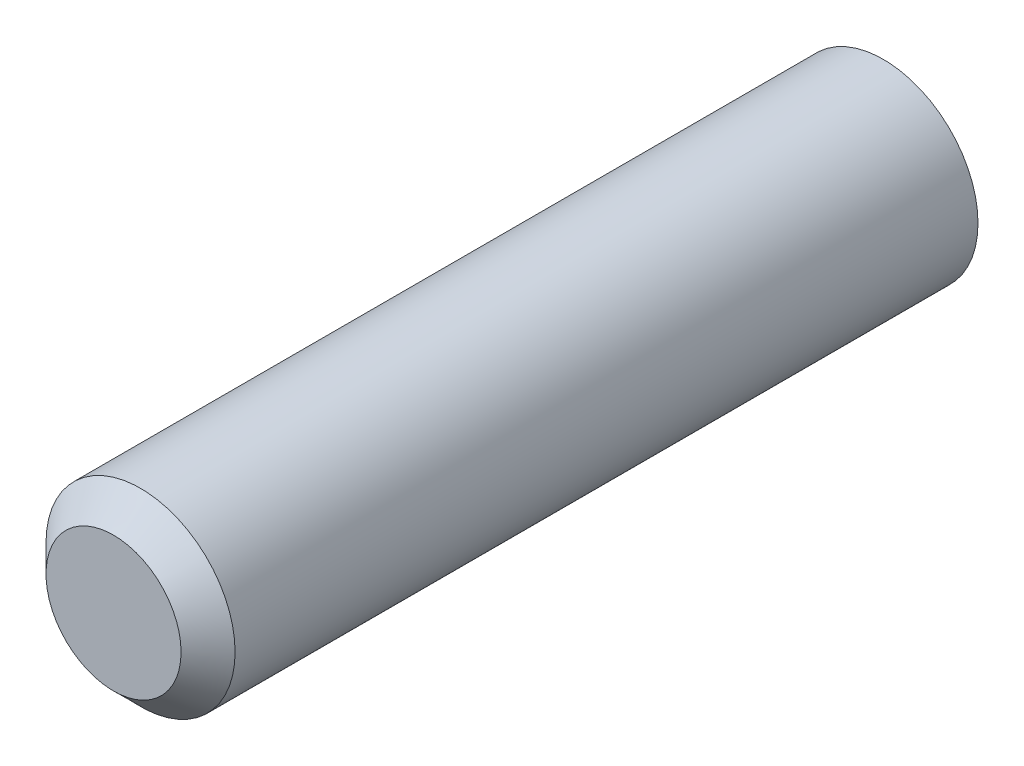
ISO-10303-21;
HEADER;
FILE_DESCRIPTION(('STEP AP214'),'2;1');
FILE_NAME('part.step','',(''),(''),'','','');
FILE_SCHEMA(('AUTOMOTIVE_DESIGN { 1 0 10303 214 1 1 1 1 }'));
ENDSEC;
DATA;
#1=APPLICATION_CONTEXT('core data for automotive mechanical design processes');
#2=APPLICATION_PROTOCOL_DEFINITION('international standard','automotive_design',2000,#1);
#3=PRODUCT_CONTEXT('',#1,'mechanical');
#4=PRODUCT('Part','Part','',(#3));
#5=PRODUCT_RELATED_PRODUCT_CATEGORY('part','',(#4));
#6=PRODUCT_DEFINITION_FORMATION('','',#4);
#7=PRODUCT_DEFINITION_CONTEXT('part definition',#1,'design');
#8=PRODUCT_DEFINITION('design','',#6,#7);
#9=PRODUCT_DEFINITION_SHAPE('','',#8);
#10=(LENGTH_UNIT() NAMED_UNIT(*) SI_UNIT(.MILLI.,.METRE.));
#11=(NAMED_UNIT(*) PLANE_ANGLE_UNIT() SI_UNIT($,.RADIAN.));
#12=(NAMED_UNIT(*) SI_UNIT($,.STERADIAN.) SOLID_ANGLE_UNIT());
#13=UNCERTAINTY_MEASURE_WITH_UNIT(LENGTH_MEASURE(1.E-05),#10,'distance_accuracy_value','');
#14=(GEOMETRIC_REPRESENTATION_CONTEXT(3) GLOBAL_UNCERTAINTY_ASSIGNED_CONTEXT((#13)) GLOBAL_UNIT_ASSIGNED_CONTEXT((#10,
#11,#12)) REPRESENTATION_CONTEXT('',''));
#15=CARTESIAN_POINT('',(0.,0.,0.));
#16=DIRECTION('',(0.,0.,1.));
#17=DIRECTION('',(1.,0.,0.));
#18=AXIS2_PLACEMENT_3D('',#15,#16,#17);
#19=CARTESIAN_POINT('',(0.,0.,570.));
#20=DIRECTION('',(0.,0.,-1.));
#21=DIRECTION('',(-1.,0.,0.));
#22=AXIS2_PLACEMENT_3D('',#19,#20,#21);
#23=CYLINDRICAL_SURFACE('',#22,70.);
#24=CARTESIAN_POINT('',(0.,0.,550.));
#25=DIRECTION('',(0.,0.,1.));
#26=DIRECTION('',(1.,0.,0.));
#27=AXIS2_PLACEMENT_3D('',#24,#25,#26);
#28=CIRCLE('',#27,70.);
#29=CARTESIAN_POINT('',(70.,0.,550.));
#30=VERTEX_POINT('',#29);
#31=EDGE_CURVE('E10',#30,#30,#28,.F.);
#32=ORIENTED_EDGE('',*,*,#31,.T.);
#33=EDGE_LOOP('',(#32));
#34=FACE_BOUND('',#33,.T.);
#35=CARTESIAN_POINT('',(0.,0.,0.));
#36=DIRECTION('',(0.,0.,1.));
#37=DIRECTION('',(1.,0.,0.));
#38=AXIS2_PLACEMENT_3D('',#35,#36,#37);
#39=CIRCLE('',#38,70.);
#40=CARTESIAN_POINT('',(70.,0.,0.));
#41=VERTEX_POINT('',#40);
#42=EDGE_CURVE('E42',#41,#41,#39,.T.);
#43=ORIENTED_EDGE('',*,*,#42,.T.);
#44=EDGE_LOOP('',(#43));
#45=FACE_BOUND('',#44,.T.);
#46=ADVANCED_FACE('F31',(#34,#45),#23,.T.);
#47=CARTESIAN_POINT('',(0.,0.,570.));
#48=DIRECTION('',(0.,0.,1.));
#49=DIRECTION('',(1.,0.,0.));
#50=AXIS2_PLACEMENT_3D('',#47,#48,#49);
#51=PLANE('',#50);
#52=CARTESIAN_POINT('',(0.,0.,570.));
#53=DIRECTION('',(0.,0.,1.));
#54=DIRECTION('',(1.,0.,0.));
#55=AXIS2_PLACEMENT_3D('',#52,#53,#54);
#56=CIRCLE('',#55,50.0000000000001);
#57=CARTESIAN_POINT('',(50.0000000000001,0.,570.));
#58=VERTEX_POINT('',#57);
#59=EDGE_CURVE('E38',#58,#58,#56,.T.);
#60=ORIENTED_EDGE('',*,*,#59,.T.);
#61=EDGE_LOOP('',(#60));
#62=FACE_BOUND('',#61,.T.);
#63=ADVANCED_FACE('F52',(#62),#51,.T.);
#64=CARTESIAN_POINT('',(0.,0.,0.));
#65=DIRECTION('',(0.,0.,1.));
#66=DIRECTION('',(1.,0.,0.));
#67=AXIS2_PLACEMENT_3D('',#64,#65,#66);
#68=PLANE('',#67);
#69=ORIENTED_EDGE('',*,*,#42,.F.);
#70=EDGE_LOOP('',(#69));
#71=FACE_BOUND('',#70,.T.);
#72=ADVANCED_FACE('F50',(#71),#68,.F.);
#73=CARTESIAN_POINT('',(0.,0.,570.));
#74=DIRECTION('',(0.,0.,-1.));
#75=DIRECTION('',(-1.,0.,0.));
#76=AXIS2_PLACEMENT_3D('',#73,#74,#75);
#77=CONICAL_SURFACE('',#76,50.0000000000001,0.785398163397446);
#78=ORIENTED_EDGE('',*,*,#31,.F.);
#79=EDGE_LOOP('',(#78));
#80=FACE_BOUND('',#79,.T.);
#81=ORIENTED_EDGE('',*,*,#59,.F.);
#82=EDGE_LOOP('',(#81));
#83=FACE_BOUND('',#82,.T.);
#84=ADVANCED_FACE('F33',(#80,#83),#77,.T.);
#85=CLOSED_SHELL('',(#46,#63,#72,#84));
#86=MANIFOLD_SOLID_BREP('B2',#85);
#87=ADVANCED_BREP_SHAPE_REPRESENTATION('',(#18,#86),#14);
#88=SHAPE_DEFINITION_REPRESENTATION(#9,#87);
ENDSEC;
END-ISO-10303-21;
